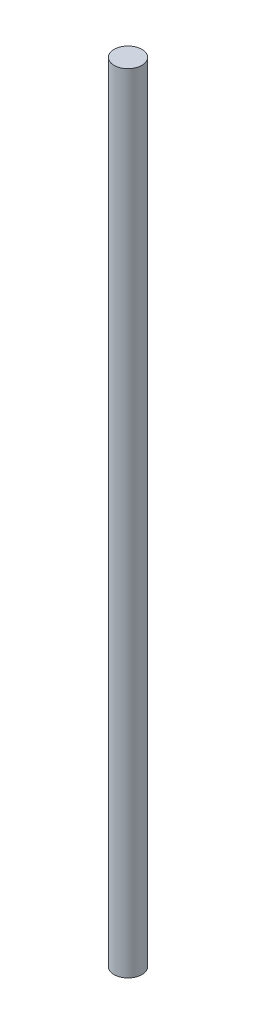
ISO-10303-21;
HEADER;
FILE_DESCRIPTION(('STEP AP214'),'2;1');
FILE_NAME('part.step','',(''),(''),'','','');
FILE_SCHEMA(('AUTOMOTIVE_DESIGN { 1 0 10303 214 1 1 1 1 }'));
ENDSEC;
DATA;
#1=APPLICATION_CONTEXT('core data for automotive mechanical design processes');
#2=APPLICATION_PROTOCOL_DEFINITION('international standard','automotive_design',2000,#1);
#3=PRODUCT_CONTEXT('',#1,'mechanical');
#4=PRODUCT('Part','Part','',(#3));
#5=PRODUCT_RELATED_PRODUCT_CATEGORY('part','',(#4));
#6=PRODUCT_DEFINITION_FORMATION('','',#4);
#7=PRODUCT_DEFINITION_CONTEXT('part definition',#1,'design');
#8=PRODUCT_DEFINITION('design','',#6,#7);
#9=PRODUCT_DEFINITION_SHAPE('','',#8);
#10=(LENGTH_UNIT() NAMED_UNIT(*) SI_UNIT(.MILLI.,.METRE.));
#11=(NAMED_UNIT(*) PLANE_ANGLE_UNIT() SI_UNIT($,.RADIAN.));
#12=(NAMED_UNIT(*) SI_UNIT($,.STERADIAN.) SOLID_ANGLE_UNIT());
#13=UNCERTAINTY_MEASURE_WITH_UNIT(LENGTH_MEASURE(1.E-05),#10,'distance_accuracy_value','');
#14=(GEOMETRIC_REPRESENTATION_CONTEXT(3) GLOBAL_UNCERTAINTY_ASSIGNED_CONTEXT((#13)) GLOBAL_UNIT_ASSIGNED_CONTEXT((#10,
#11,#12)) REPRESENTATION_CONTEXT('',''));
#15=CARTESIAN_POINT('',(0.,0.,0.));
#16=DIRECTION('',(0.,0.,1.));
#17=DIRECTION('',(1.,0.,0.));
#18=AXIS2_PLACEMENT_3D('',#15,#16,#17);
#19=CARTESIAN_POINT('',(0.,360.,0.));
#20=DIRECTION('',(0.,-1.,0.));
#21=DIRECTION('',(0.,0.,-1.));
#22=AXIS2_PLACEMENT_3D('',#19,#20,#21);
#23=CYLINDRICAL_SURFACE('',#22,6.35);
#24=CARTESIAN_POINT('',(0.,360.,0.));
#25=DIRECTION('',(0.,1.,0.));
#26=DIRECTION('',(0.,0.,1.));
#27=AXIS2_PLACEMENT_3D('',#24,#25,#26);
#28=CIRCLE('',#27,6.35);
#29=CARTESIAN_POINT('',(0.,360.,6.35));
#30=VERTEX_POINT('',#29);
#31=EDGE_CURVE('E10',#30,#30,#28,.T.);
#32=ORIENTED_EDGE('',*,*,#31,.F.);
#33=EDGE_LOOP('',(#32));
#34=FACE_BOUND('',#33,.T.);
#35=CARTESIAN_POINT('',(0.,0.,0.));
#36=DIRECTION('',(0.,1.,0.));
#37=DIRECTION('',(0.,0.,1.));
#38=AXIS2_PLACEMENT_3D('',#35,#36,#37);
#39=CIRCLE('',#38,6.35);
#40=CARTESIAN_POINT('',(0.,0.,6.35));
#41=VERTEX_POINT('',#40);
#42=EDGE_CURVE('E34',#41,#41,#39,.T.);
#43=ORIENTED_EDGE('',*,*,#42,.T.);
#44=EDGE_LOOP('',(#43));
#45=FACE_BOUND('',#44,.T.);
#46=ADVANCED_FACE('F31',(#34,#45),#23,.T.);
#47=CARTESIAN_POINT('',(0.,360.,0.));
#48=DIRECTION('',(0.,1.,0.));
#49=DIRECTION('',(0.,0.,1.));
#50=AXIS2_PLACEMENT_3D('',#47,#48,#49);
#51=PLANE('',#50);
#52=ORIENTED_EDGE('',*,*,#31,.T.);
#53=EDGE_LOOP('',(#52));
#54=FACE_BOUND('',#53,.T.);
#55=ADVANCED_FACE('F46',(#54),#51,.T.);
#56=CARTESIAN_POINT('',(0.,0.,0.));
#57=DIRECTION('',(0.,1.,0.));
#58=DIRECTION('',(0.,0.,1.));
#59=AXIS2_PLACEMENT_3D('',#56,#57,#58);
#60=PLANE('',#59);
#61=ORIENTED_EDGE('',*,*,#42,.F.);
#62=EDGE_LOOP('',(#61));
#63=FACE_BOUND('',#62,.T.);
#64=ADVANCED_FACE('F44',(#63),#60,.F.);
#65=CLOSED_SHELL('',(#46,#55,#64));
#66=MANIFOLD_SOLID_BREP('B2',#65);
#67=ADVANCED_BREP_SHAPE_REPRESENTATION('',(#18,#66),#14);
#68=SHAPE_DEFINITION_REPRESENTATION(#9,#67);
ENDSEC;
END-ISO-10303-21;
